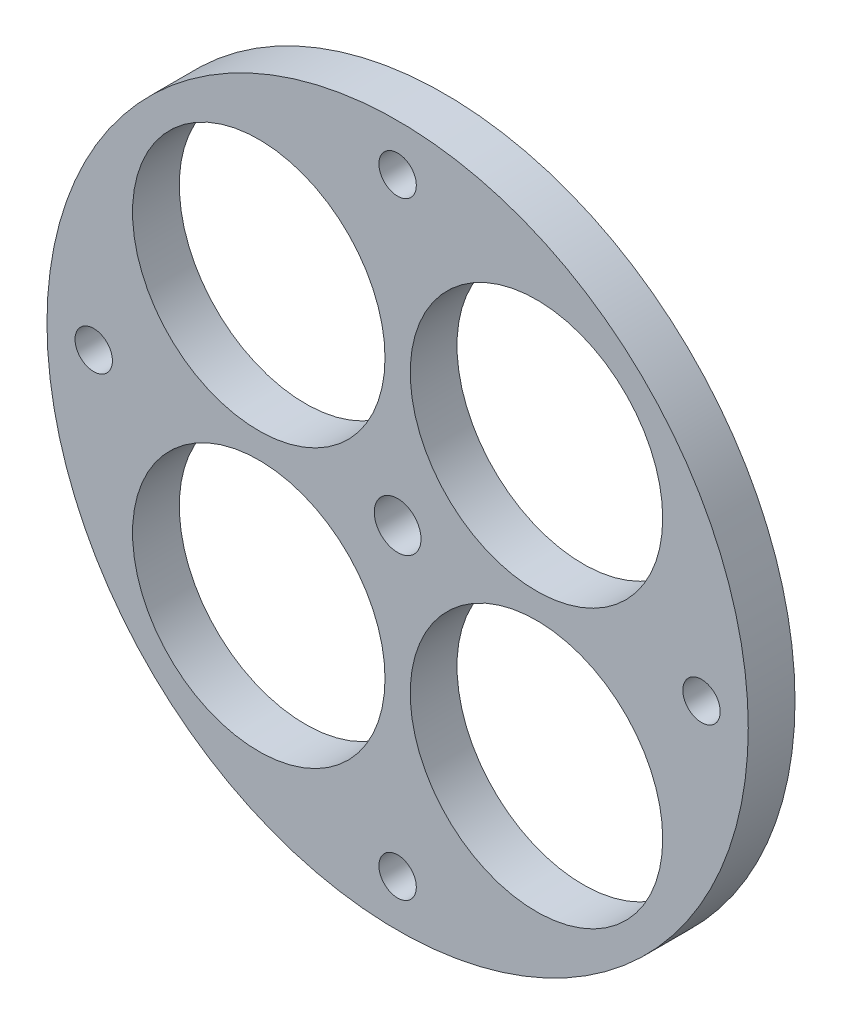
ISO-10303-21;
HEADER;
FILE_DESCRIPTION(('STEP AP214'),'2;1');
FILE_NAME('part.step','',(''),(''),'','','');
FILE_SCHEMA(('AUTOMOTIVE_DESIGN { 1 0 10303 214 1 1 1 1 }'));
ENDSEC;
DATA;
#1=APPLICATION_CONTEXT('core data for automotive mechanical design processes');
#2=APPLICATION_PROTOCOL_DEFINITION('international standard','automotive_design',2000,#1);
#3=PRODUCT_CONTEXT('',#1,'mechanical');
#4=PRODUCT('Part','Part','',(#3));
#5=PRODUCT_RELATED_PRODUCT_CATEGORY('part','',(#4));
#6=PRODUCT_DEFINITION_FORMATION('','',#4);
#7=PRODUCT_DEFINITION_CONTEXT('part definition',#1,'design');
#8=PRODUCT_DEFINITION('design','',#6,#7);
#9=PRODUCT_DEFINITION_SHAPE('','',#8);
#10=(LENGTH_UNIT() NAMED_UNIT(*) SI_UNIT(.MILLI.,.METRE.));
#11=(NAMED_UNIT(*) PLANE_ANGLE_UNIT() SI_UNIT($,.RADIAN.));
#12=(NAMED_UNIT(*) SI_UNIT($,.STERADIAN.) SOLID_ANGLE_UNIT());
#13=UNCERTAINTY_MEASURE_WITH_UNIT(LENGTH_MEASURE(1.E-05),#10,'distance_accuracy_value','');
#14=(GEOMETRIC_REPRESENTATION_CONTEXT(3) GLOBAL_UNCERTAINTY_ASSIGNED_CONTEXT((#13)) GLOBAL_UNIT_ASSIGNED_CONTEXT((#10,
#11,#12)) REPRESENTATION_CONTEXT('',''));
#15=CARTESIAN_POINT('',(0.,0.,0.));
#16=DIRECTION('',(0.,0.,1.));
#17=DIRECTION('',(1.,0.,0.));
#18=AXIS2_PLACEMENT_3D('',#15,#16,#17);
#19=CARTESIAN_POINT('',(0.,0.,10.));
#20=DIRECTION('',(0.,0.,1.));
#21=DIRECTION('',(1.,0.,0.));
#22=AXIS2_PLACEMENT_3D('',#19,#20,#21);
#23=PLANE('',#22);
#24=CARTESIAN_POINT('',(0.,-65.,10.));
#25=DIRECTION('',(0.,0.,1.));
#26=DIRECTION('',(1.,0.,0.));
#27=AXIS2_PLACEMENT_3D('',#24,#25,#26);
#28=CIRCLE('',#27,4.);
#29=CARTESIAN_POINT('',(4.,-65.,10.));
#30=VERTEX_POINT('',#29);
#31=EDGE_CURVE('E85',#30,#30,#28,.T.);
#32=ORIENTED_EDGE('',*,*,#31,.F.);
#33=EDGE_LOOP('',(#32));
#34=FACE_BOUND('',#33,.T.);
#35=CARTESIAN_POINT('',(0.,65.,10.));
#36=DIRECTION('',(0.,0.,1.));
#37=DIRECTION('',(1.,0.,0.));
#38=AXIS2_PLACEMENT_3D('',#35,#36,#37);
#39=CIRCLE('',#38,4.);
#40=CARTESIAN_POINT('',(4.,65.,10.));
#41=VERTEX_POINT('',#40);
#42=EDGE_CURVE('E73',#41,#41,#39,.T.);
#43=ORIENTED_EDGE('',*,*,#42,.F.);
#44=EDGE_LOOP('',(#43));
#45=FACE_BOUND('',#44,.T.);
#46=CARTESIAN_POINT('',(29.6984848098366,-29.6984848098334,10.));
#47=DIRECTION('',(0.,0.,1.));
#48=DIRECTION('',(1.,0.,0.));
#49=AXIS2_PLACEMENT_3D('',#46,#47,#48);
#50=CIRCLE('',#49,27.);
#51=CARTESIAN_POINT('',(56.6984848098366,-29.6984848098334,10.));
#52=VERTEX_POINT('',#51);
#53=EDGE_CURVE('E61',#52,#52,#50,.T.);
#54=ORIENTED_EDGE('',*,*,#53,.F.);
#55=EDGE_LOOP('',(#54));
#56=FACE_BOUND('',#55,.T.);
#57=CARTESIAN_POINT('',(0.,0.,10.));
#58=DIRECTION('',(0.,0.,1.));
#59=DIRECTION('',(1.,0.,0.));
#60=AXIS2_PLACEMENT_3D('',#57,#58,#59);
#61=CIRCLE('',#60,5.);
#62=CARTESIAN_POINT('',(5.,0.,10.));
#63=VERTEX_POINT('',#62);
#64=EDGE_CURVE('E49',#63,#63,#61,.T.);
#65=ORIENTED_EDGE('',*,*,#64,.F.);
#66=EDGE_LOOP('',(#65));
#67=FACE_BOUND('',#66,.T.);
#68=CARTESIAN_POINT('',(0.,0.,10.));
#69=DIRECTION('',(0.,0.,1.));
#70=DIRECTION('',(1.,0.,0.));
#71=AXIS2_PLACEMENT_3D('',#68,#69,#70);
#72=CIRCLE('',#71,75.);
#73=CARTESIAN_POINT('',(75.,0.,10.));
#74=VERTEX_POINT('',#73);
#75=EDGE_CURVE('E10',#74,#74,#72,.T.);
#76=ORIENTED_EDGE('',*,*,#75,.T.);
#77=EDGE_LOOP('',(#76));
#78=FACE_BOUND('',#77,.T.);
#79=CARTESIAN_POINT('',(-29.6984848098349,29.6984848098351,10.));
#80=DIRECTION('',(0.,0.,1.));
#81=DIRECTION('',(1.,0.,0.));
#82=AXIS2_PLACEMENT_3D('',#79,#80,#81);
#83=CIRCLE('',#82,27.);
#84=CARTESIAN_POINT('',(-2.69848480983494,29.6984848098351,10.));
#85=VERTEX_POINT('',#84);
#86=EDGE_CURVE('E44',#85,#85,#83,.T.);
#87=ORIENTED_EDGE('',*,*,#86,.F.);
#88=EDGE_LOOP('',(#87));
#89=FACE_BOUND('',#88,.T.);
#90=CARTESIAN_POINT('',(29.6984848098351,29.6984848098366,10.));
#91=DIRECTION('',(0.,0.,1.));
#92=DIRECTION('',(1.,0.,0.));
#93=AXIS2_PLACEMENT_3D('',#90,#91,#92);
#94=CIRCLE('',#93,27.);
#95=CARTESIAN_POINT('',(56.6984848098351,29.6984848098366,10.));
#96=VERTEX_POINT('',#95);
#97=EDGE_CURVE('E55',#96,#96,#94,.T.);
#98=ORIENTED_EDGE('',*,*,#97,.F.);
#99=EDGE_LOOP('',(#98));
#100=FACE_BOUND('',#99,.T.);
#101=CARTESIAN_POINT('',(-29.6984848098334,-29.6984848098349,10.));
#102=DIRECTION('',(0.,0.,1.));
#103=DIRECTION('',(1.,0.,0.));
#104=AXIS2_PLACEMENT_3D('',#101,#102,#103);
#105=CIRCLE('',#104,27.);
#106=CARTESIAN_POINT('',(-2.69848480983336,-29.6984848098349,10.));
#107=VERTEX_POINT('',#106);
#108=EDGE_CURVE('E67',#107,#107,#105,.T.);
#109=ORIENTED_EDGE('',*,*,#108,.F.);
#110=EDGE_LOOP('',(#109));
#111=FACE_BOUND('',#110,.T.);
#112=CARTESIAN_POINT('',(65.,0.,10.));
#113=DIRECTION('',(0.,0.,1.));
#114=DIRECTION('',(1.,0.,0.));
#115=AXIS2_PLACEMENT_3D('',#112,#113,#114);
#116=CIRCLE('',#115,4.00000000000001);
#117=CARTESIAN_POINT('',(69.,0.,10.));
#118=VERTEX_POINT('',#117);
#119=EDGE_CURVE('E79',#118,#118,#116,.T.);
#120=ORIENTED_EDGE('',*,*,#119,.F.);
#121=EDGE_LOOP('',(#120));
#122=FACE_BOUND('',#121,.T.);
#123=CARTESIAN_POINT('',(-65.,0.,10.));
#124=DIRECTION('',(0.,0.,1.));
#125=DIRECTION('',(1.,0.,0.));
#126=AXIS2_PLACEMENT_3D('',#123,#124,#125);
#127=CIRCLE('',#126,4.00000000000001);
#128=CARTESIAN_POINT('',(-61.,0.,10.));
#129=VERTEX_POINT('',#128);
#130=EDGE_CURVE('E91',#129,#129,#127,.T.);
#131=ORIENTED_EDGE('',*,*,#130,.F.);
#132=EDGE_LOOP('',(#131));
#133=FACE_BOUND('',#132,.T.);
#134=ADVANCED_FACE('F33',(#34,#45,#56,#67,#78,#89,#100,#111,#122,#133),#23,.T.);
#135=CARTESIAN_POINT('',(0.,0.,0.));
#136=DIRECTION('',(0.,0.,1.));
#137=DIRECTION('',(1.,0.,0.));
#138=AXIS2_PLACEMENT_3D('',#135,#136,#137);
#139=PLANE('',#138);
#140=CARTESIAN_POINT('',(0.,0.,0.));
#141=DIRECTION('',(0.,0.,1.));
#142=DIRECTION('',(1.,0.,0.));
#143=AXIS2_PLACEMENT_3D('',#140,#141,#142);
#144=CIRCLE('',#143,75.);
#145=CARTESIAN_POINT('',(75.,0.,0.));
#146=VERTEX_POINT('',#145);
#147=EDGE_CURVE('E37',#146,#146,#144,.T.);
#148=ORIENTED_EDGE('',*,*,#147,.F.);
#149=EDGE_LOOP('',(#148));
#150=FACE_BOUND('',#149,.T.);
#151=CARTESIAN_POINT('',(-29.6984848098349,29.6984848098351,0.));
#152=DIRECTION('',(0.,0.,1.));
#153=DIRECTION('',(1.,0.,0.));
#154=AXIS2_PLACEMENT_3D('',#151,#152,#153);
#155=CIRCLE('',#154,27.);
#156=CARTESIAN_POINT('',(-2.69848480983494,29.6984848098351,0.));
#157=VERTEX_POINT('',#156);
#158=EDGE_CURVE('E46',#157,#157,#155,.T.);
#159=ORIENTED_EDGE('',*,*,#158,.T.);
#160=EDGE_LOOP('',(#159));
#161=FACE_BOUND('',#160,.T.);
#162=CARTESIAN_POINT('',(0.,0.,0.));
#163=DIRECTION('',(0.,0.,1.));
#164=DIRECTION('',(1.,0.,0.));
#165=AXIS2_PLACEMENT_3D('',#162,#163,#164);
#166=CIRCLE('',#165,5.);
#167=CARTESIAN_POINT('',(5.,0.,0.));
#168=VERTEX_POINT('',#167);
#169=EDGE_CURVE('E52',#168,#168,#166,.T.);
#170=ORIENTED_EDGE('',*,*,#169,.T.);
#171=EDGE_LOOP('',(#170));
#172=FACE_BOUND('',#171,.T.);
#173=CARTESIAN_POINT('',(29.6984848098351,29.6984848098366,0.));
#174=DIRECTION('',(0.,0.,1.));
#175=DIRECTION('',(1.,0.,0.));
#176=AXIS2_PLACEMENT_3D('',#173,#174,#175);
#177=CIRCLE('',#176,27.);
#178=CARTESIAN_POINT('',(56.6984848098351,29.6984848098366,0.));
#179=VERTEX_POINT('',#178);
#180=EDGE_CURVE('E58',#179,#179,#177,.T.);
#181=ORIENTED_EDGE('',*,*,#180,.T.);
#182=EDGE_LOOP('',(#181));
#183=FACE_BOUND('',#182,.T.);
#184=CARTESIAN_POINT('',(29.6984848098366,-29.6984848098334,0.));
#185=DIRECTION('',(0.,0.,1.));
#186=DIRECTION('',(1.,0.,0.));
#187=AXIS2_PLACEMENT_3D('',#184,#185,#186);
#188=CIRCLE('',#187,27.);
#189=CARTESIAN_POINT('',(56.6984848098366,-29.6984848098334,0.));
#190=VERTEX_POINT('',#189);
#191=EDGE_CURVE('E64',#190,#190,#188,.T.);
#192=ORIENTED_EDGE('',*,*,#191,.T.);
#193=EDGE_LOOP('',(#192));
#194=FACE_BOUND('',#193,.T.);
#195=CARTESIAN_POINT('',(-29.6984848098334,-29.6984848098349,0.));
#196=DIRECTION('',(0.,0.,1.));
#197=DIRECTION('',(1.,0.,0.));
#198=AXIS2_PLACEMENT_3D('',#195,#196,#197);
#199=CIRCLE('',#198,27.);
#200=CARTESIAN_POINT('',(-2.69848480983336,-29.6984848098349,0.));
#201=VERTEX_POINT('',#200);
#202=EDGE_CURVE('E70',#201,#201,#199,.T.);
#203=ORIENTED_EDGE('',*,*,#202,.T.);
#204=EDGE_LOOP('',(#203));
#205=FACE_BOUND('',#204,.T.);
#206=CARTESIAN_POINT('',(0.,65.,0.));
#207=DIRECTION('',(0.,0.,1.));
#208=DIRECTION('',(1.,0.,0.));
#209=AXIS2_PLACEMENT_3D('',#206,#207,#208);
#210=CIRCLE('',#209,4.);
#211=CARTESIAN_POINT('',(4.,65.,0.));
#212=VERTEX_POINT('',#211);
#213=EDGE_CURVE('E76',#212,#212,#210,.T.);
#214=ORIENTED_EDGE('',*,*,#213,.T.);
#215=EDGE_LOOP('',(#214));
#216=FACE_BOUND('',#215,.T.);
#217=CARTESIAN_POINT('',(65.,0.,0.));
#218=DIRECTION('',(0.,0.,1.));
#219=DIRECTION('',(1.,0.,0.));
#220=AXIS2_PLACEMENT_3D('',#217,#218,#219);
#221=CIRCLE('',#220,4.00000000000001);
#222=CARTESIAN_POINT('',(69.,0.,0.));
#223=VERTEX_POINT('',#222);
#224=EDGE_CURVE('E82',#223,#223,#221,.T.);
#225=ORIENTED_EDGE('',*,*,#224,.T.);
#226=EDGE_LOOP('',(#225));
#227=FACE_BOUND('',#226,.T.);
#228=CARTESIAN_POINT('',(0.,-65.,0.));
#229=DIRECTION('',(0.,0.,1.));
#230=DIRECTION('',(1.,0.,0.));
#231=AXIS2_PLACEMENT_3D('',#228,#229,#230);
#232=CIRCLE('',#231,4.);
#233=CARTESIAN_POINT('',(4.,-65.,0.));
#234=VERTEX_POINT('',#233);
#235=EDGE_CURVE('E88',#234,#234,#232,.T.);
#236=ORIENTED_EDGE('',*,*,#235,.T.);
#237=EDGE_LOOP('',(#236));
#238=FACE_BOUND('',#237,.T.);
#239=CARTESIAN_POINT('',(-65.,0.,0.));
#240=DIRECTION('',(0.,0.,1.));
#241=DIRECTION('',(1.,0.,0.));
#242=AXIS2_PLACEMENT_3D('',#239,#240,#241);
#243=CIRCLE('',#242,4.00000000000001);
#244=CARTESIAN_POINT('',(-61.,0.,0.));
#245=VERTEX_POINT('',#244);
#246=EDGE_CURVE('E94',#245,#245,#243,.T.);
#247=ORIENTED_EDGE('',*,*,#246,.T.);
#248=EDGE_LOOP('',(#247));
#249=FACE_BOUND('',#248,.T.);
#250=ADVANCED_FACE('F104',(#150,#161,#172,#183,#194,#205,#216,#227,#238,#249),#139,.F.);
#251=CARTESIAN_POINT('',(0.,0.,10.));
#252=DIRECTION('',(0.,0.,-1.));
#253=DIRECTION('',(-1.,0.,0.));
#254=AXIS2_PLACEMENT_3D('',#251,#252,#253);
#255=CYLINDRICAL_SURFACE('',#254,75.);
#256=ORIENTED_EDGE('',*,*,#75,.F.);
#257=EDGE_LOOP('',(#256));
#258=FACE_BOUND('',#257,.T.);
#259=ORIENTED_EDGE('',*,*,#147,.T.);
#260=EDGE_LOOP('',(#259));
#261=FACE_BOUND('',#260,.T.);
#262=ADVANCED_FACE('F35',(#258,#261),#255,.T.);
#263=CARTESIAN_POINT('',(-29.6984848098349,29.6984848098351,10.));
#264=DIRECTION('',(0.,0.,-1.));
#265=DIRECTION('',(-1.,0.,0.));
#266=AXIS2_PLACEMENT_3D('',#263,#264,#265);
#267=CYLINDRICAL_SURFACE('',#266,27.);
#268=ORIENTED_EDGE('',*,*,#86,.T.);
#269=EDGE_LOOP('',(#268));
#270=FACE_BOUND('',#269,.T.);
#271=ORIENTED_EDGE('',*,*,#158,.F.);
#272=EDGE_LOOP('',(#271));
#273=FACE_BOUND('',#272,.T.);
#274=ADVANCED_FACE('F114',(#270,#273),#267,.F.);
#275=CARTESIAN_POINT('',(0.,0.,10.));
#276=DIRECTION('',(0.,0.,-1.));
#277=DIRECTION('',(-1.,0.,0.));
#278=AXIS2_PLACEMENT_3D('',#275,#276,#277);
#279=CYLINDRICAL_SURFACE('',#278,5.);
#280=ORIENTED_EDGE('',*,*,#64,.T.);
#281=EDGE_LOOP('',(#280));
#282=FACE_BOUND('',#281,.T.);
#283=ORIENTED_EDGE('',*,*,#169,.F.);
#284=EDGE_LOOP('',(#283));
#285=FACE_BOUND('',#284,.T.);
#286=ADVANCED_FACE('F117',(#282,#285),#279,.F.);
#287=CARTESIAN_POINT('',(29.6984848098351,29.6984848098366,10.));
#288=DIRECTION('',(0.,0.,-1.));
#289=DIRECTION('',(-1.,0.,0.));
#290=AXIS2_PLACEMENT_3D('',#287,#288,#289);
#291=CYLINDRICAL_SURFACE('',#290,27.);
#292=ORIENTED_EDGE('',*,*,#97,.T.);
#293=EDGE_LOOP('',(#292));
#294=FACE_BOUND('',#293,.T.);
#295=ORIENTED_EDGE('',*,*,#180,.F.);
#296=EDGE_LOOP('',(#295));
#297=FACE_BOUND('',#296,.T.);
#298=ADVANCED_FACE('F121',(#294,#297),#291,.F.);
#299=CARTESIAN_POINT('',(29.6984848098366,-29.6984848098334,10.));
#300=DIRECTION('',(0.,0.,-1.));
#301=DIRECTION('',(-1.,0.,0.));
#302=AXIS2_PLACEMENT_3D('',#299,#300,#301);
#303=CYLINDRICAL_SURFACE('',#302,27.);
#304=ORIENTED_EDGE('',*,*,#53,.T.);
#305=EDGE_LOOP('',(#304));
#306=FACE_BOUND('',#305,.T.);
#307=ORIENTED_EDGE('',*,*,#191,.F.);
#308=EDGE_LOOP('',(#307));
#309=FACE_BOUND('',#308,.T.);
#310=ADVANCED_FACE('F125',(#306,#309),#303,.F.);
#311=CARTESIAN_POINT('',(-29.6984848098334,-29.6984848098349,10.));
#312=DIRECTION('',(0.,0.,-1.));
#313=DIRECTION('',(-1.,0.,0.));
#314=AXIS2_PLACEMENT_3D('',#311,#312,#313);
#315=CYLINDRICAL_SURFACE('',#314,27.);
#316=ORIENTED_EDGE('',*,*,#108,.T.);
#317=EDGE_LOOP('',(#316));
#318=FACE_BOUND('',#317,.T.);
#319=ORIENTED_EDGE('',*,*,#202,.F.);
#320=EDGE_LOOP('',(#319));
#321=FACE_BOUND('',#320,.T.);
#322=ADVANCED_FACE('F129',(#318,#321),#315,.F.);
#323=CARTESIAN_POINT('',(0.,65.,10.));
#324=DIRECTION('',(0.,0.,-1.));
#325=DIRECTION('',(-1.,0.,0.));
#326=AXIS2_PLACEMENT_3D('',#323,#324,#325);
#327=CYLINDRICAL_SURFACE('',#326,4.);
#328=ORIENTED_EDGE('',*,*,#42,.T.);
#329=EDGE_LOOP('',(#328));
#330=FACE_BOUND('',#329,.T.);
#331=ORIENTED_EDGE('',*,*,#213,.F.);
#332=EDGE_LOOP('',(#331));
#333=FACE_BOUND('',#332,.T.);
#334=ADVANCED_FACE('F133',(#330,#333),#327,.F.);
#335=CARTESIAN_POINT('',(65.,0.,10.));
#336=DIRECTION('',(0.,0.,-1.));
#337=DIRECTION('',(-1.,0.,0.));
#338=AXIS2_PLACEMENT_3D('',#335,#336,#337);
#339=CYLINDRICAL_SURFACE('',#338,4.00000000000001);
#340=ORIENTED_EDGE('',*,*,#119,.T.);
#341=EDGE_LOOP('',(#340));
#342=FACE_BOUND('',#341,.T.);
#343=ORIENTED_EDGE('',*,*,#224,.F.);
#344=EDGE_LOOP('',(#343));
#345=FACE_BOUND('',#344,.T.);
#346=ADVANCED_FACE('F137',(#342,#345),#339,.F.);
#347=CARTESIAN_POINT('',(0.,-65.,10.));
#348=DIRECTION('',(0.,0.,-1.));
#349=DIRECTION('',(-1.,0.,0.));
#350=AXIS2_PLACEMENT_3D('',#347,#348,#349);
#351=CYLINDRICAL_SURFACE('',#350,4.);
#352=ORIENTED_EDGE('',*,*,#31,.T.);
#353=EDGE_LOOP('',(#352));
#354=FACE_BOUND('',#353,.T.);
#355=ORIENTED_EDGE('',*,*,#235,.F.);
#356=EDGE_LOOP('',(#355));
#357=FACE_BOUND('',#356,.T.);
#358=ADVANCED_FACE('F141',(#354,#357),#351,.F.);
#359=CARTESIAN_POINT('',(-65.,0.,10.));
#360=DIRECTION('',(0.,0.,-1.));
#361=DIRECTION('',(-1.,0.,0.));
#362=AXIS2_PLACEMENT_3D('',#359,#360,#361);
#363=CYLINDRICAL_SURFACE('',#362,4.00000000000001);
#364=ORIENTED_EDGE('',*,*,#130,.T.);
#365=EDGE_LOOP('',(#364));
#366=FACE_BOUND('',#365,.T.);
#367=ORIENTED_EDGE('',*,*,#246,.F.);
#368=EDGE_LOOP('',(#367));
#369=FACE_BOUND('',#368,.T.);
#370=ADVANCED_FACE('F100',(#366,#369),#363,.F.);
#371=CLOSED_SHELL('',(#134,#250,#262,#274,#286,#298,#310,#322,#334,#346,#358,#370));
#372=MANIFOLD_SOLID_BREP('B2',#371);
#373=ADVANCED_BREP_SHAPE_REPRESENTATION('',(#18,#372),#14);
#374=SHAPE_DEFINITION_REPRESENTATION(#9,#373);
ENDSEC;
END-ISO-10303-21;
